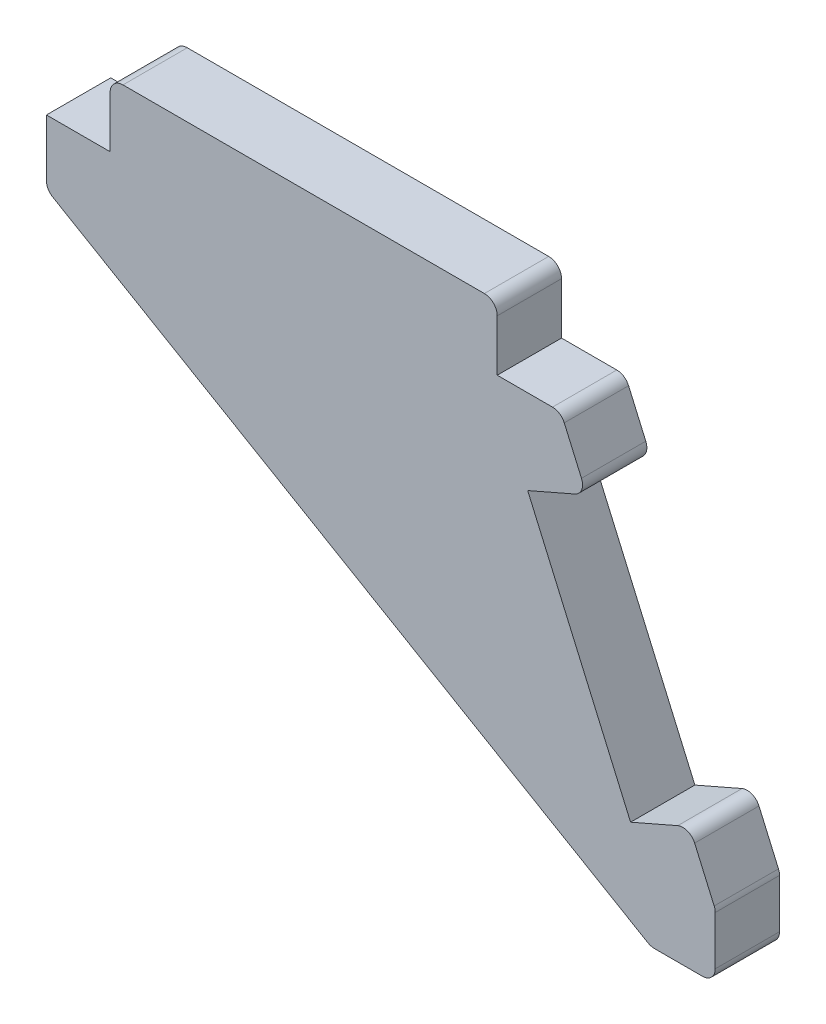
ISO-10303-21;
HEADER;
FILE_DESCRIPTION(('STEP AP214'),'2;1');
FILE_NAME('part.step','',(''),(''),'','','');
FILE_SCHEMA(('AUTOMOTIVE_DESIGN { 1 0 10303 214 1 1 1 1 }'));
ENDSEC;
DATA;
#1=APPLICATION_CONTEXT('core data for automotive mechanical design processes');
#2=APPLICATION_PROTOCOL_DEFINITION('international standard','automotive_design',2000,#1);
#3=PRODUCT_CONTEXT('',#1,'mechanical');
#4=PRODUCT('Part','Part','',(#3));
#5=PRODUCT_RELATED_PRODUCT_CATEGORY('part','',(#4));
#6=PRODUCT_DEFINITION_FORMATION('','',#4);
#7=PRODUCT_DEFINITION_CONTEXT('part definition',#1,'design');
#8=PRODUCT_DEFINITION('design','',#6,#7);
#9=PRODUCT_DEFINITION_SHAPE('','',#8);
#10=(LENGTH_UNIT() NAMED_UNIT(*) SI_UNIT(.MILLI.,.METRE.));
#11=(NAMED_UNIT(*) PLANE_ANGLE_UNIT() SI_UNIT($,.RADIAN.));
#12=(NAMED_UNIT(*) SI_UNIT($,.STERADIAN.) SOLID_ANGLE_UNIT());
#13=UNCERTAINTY_MEASURE_WITH_UNIT(LENGTH_MEASURE(1.E-05),#10,'distance_accuracy_value','');
#14=(GEOMETRIC_REPRESENTATION_CONTEXT(3) GLOBAL_UNCERTAINTY_ASSIGNED_CONTEXT((#13)) GLOBAL_UNIT_ASSIGNED_CONTEXT((#10,
#11,#12)) REPRESENTATION_CONTEXT('',''));
#15=CARTESIAN_POINT('',(0.,0.,0.));
#16=DIRECTION('',(0.,0.,1.));
#17=DIRECTION('',(1.,0.,0.));
#18=AXIS2_PLACEMENT_3D('',#15,#16,#17);
#19=CARTESIAN_POINT('',(4.95,5.00000000000043,5.));
#20=DIRECTION('',(1.,0.,0.));
#21=DIRECTION('',(0.,1.,0.));
#22=AXIS2_PLACEMENT_3D('',#19,#20,#21);
#23=PLANE('',#22);
#24=DIRECTION('',(0.,-1.,0.));
#25=VECTOR('',#24,1.);
#26=CARTESIAN_POINT('',(4.95,5.00000000000043,5.));
#27=LINE('',#26,#25);
#28=CARTESIAN_POINT('',(4.95,4.00000000000043,5.));
#29=VERTEX_POINT('',#28);
#30=CARTESIAN_POINT('',(4.95,0.,5.));
#31=VERTEX_POINT('',#30);
#32=EDGE_CURVE('E195',#29,#31,#27,.T.);
#33=ORIENTED_EDGE('',*,*,#32,.F.);
#34=DIRECTION('',(0.,0.,-1.));
#35=VECTOR('',#34,1.);
#36=CARTESIAN_POINT('',(4.95,4.00000000000043,5.));
#37=LINE('',#36,#35);
#38=CARTESIAN_POINT('',(4.95,4.00000000000043,0.));
#39=VERTEX_POINT('',#38);
#40=EDGE_CURVE('E11',#29,#39,#37,.T.);
#41=ORIENTED_EDGE('',*,*,#40,.T.);
#42=DIRECTION('',(0.,-1.,0.));
#43=VECTOR('',#42,1.);
#44=CARTESIAN_POINT('',(4.95,5.00000000000043,0.));
#45=LINE('',#44,#43);
#46=CARTESIAN_POINT('',(4.95,0.,0.));
#47=VERTEX_POINT('',#46);
#48=EDGE_CURVE('E219',#39,#47,#45,.T.);
#49=ORIENTED_EDGE('',*,*,#48,.T.);
#50=DIRECTION('',(0.,0.,-1.));
#51=VECTOR('',#50,1.);
#52=CARTESIAN_POINT('',(4.95,0.,5.));
#53=LINE('',#52,#51);
#54=EDGE_CURVE('E212',#31,#47,#53,.T.);
#55=ORIENTED_EDGE('',*,*,#54,.F.);
#56=EDGE_LOOP('',(#33,#41,#49,#55));
#57=FACE_BOUND('',#56,.T.);
#58=ADVANCED_FACE('F40',(#57),#23,.F.);
#59=CARTESIAN_POINT('',(4.95,0.,5.));
#60=DIRECTION('',(0.,-1.,0.));
#61=DIRECTION('',(1.,0.,0.));
#62=AXIS2_PLACEMENT_3D('',#59,#60,#61);
#63=PLANE('',#62);
#64=DIRECTION('',(-1.,0.,0.));
#65=VECTOR('',#64,1.);
#66=CARTESIAN_POINT('',(4.95,0.,0.));
#67=LINE('',#66,#65);
#68=CARTESIAN_POINT('',(0.,0.,0.));
#69=VERTEX_POINT('',#68);
#70=EDGE_CURVE('E373',#47,#69,#67,.T.);
#71=ORIENTED_EDGE('',*,*,#70,.T.);
#72=DIRECTION('',(0.,0.,-1.));
#73=VECTOR('',#72,1.);
#74=CARTESIAN_POINT('',(0.,0.,5.));
#75=LINE('',#74,#73);
#76=CARTESIAN_POINT('',(0.,0.,5.));
#77=VERTEX_POINT('',#76);
#78=EDGE_CURVE('E214',#77,#69,#75,.T.);
#79=ORIENTED_EDGE('',*,*,#78,.F.);
#80=DIRECTION('',(-1.,0.,0.));
#81=VECTOR('',#80,1.);
#82=CARTESIAN_POINT('',(4.95,0.,5.));
#83=LINE('',#82,#81);
#84=EDGE_CURVE('E200',#31,#77,#83,.T.);
#85=ORIENTED_EDGE('',*,*,#84,.F.);
#86=ORIENTED_EDGE('',*,*,#54,.T.);
#87=EDGE_LOOP('',(#71,#79,#85,#86));
#88=FACE_BOUND('',#87,.T.);
#89=ADVANCED_FACE('F211',(#88),#63,.F.);
#90=CARTESIAN_POINT('',(0.,0.,5.));
#91=DIRECTION('',(1.,0.,0.));
#92=DIRECTION('',(0.,1.,0.));
#93=AXIS2_PLACEMENT_3D('',#90,#91,#92);
#94=PLANE('',#93);
#95=DIRECTION('',(0.,-1.,0.));
#96=VECTOR('',#95,1.);
#97=CARTESIAN_POINT('',(0.,0.,0.));
#98=LINE('',#97,#96);
#99=CARTESIAN_POINT('',(0.,-4.42646043849972,0.));
#100=VERTEX_POINT('',#99);
#101=EDGE_CURVE('E375',#69,#100,#98,.T.);
#102=ORIENTED_EDGE('',*,*,#101,.T.);
#103=DIRECTION('',(0.,0.,-1.));
#104=VECTOR('',#103,1.);
#105=CARTESIAN_POINT('',(0.,-4.42646043849972,5.));
#106=LINE('',#105,#104);
#107=CARTESIAN_POINT('',(0.,-4.42646043849972,5.));
#108=VERTEX_POINT('',#107);
#109=EDGE_CURVE('E273',#100,#108,#106,.F.);
#110=ORIENTED_EDGE('',*,*,#109,.T.);
#111=DIRECTION('',(0.,-1.,0.));
#112=VECTOR('',#111,1.);
#113=CARTESIAN_POINT('',(0.,0.,5.));
#114=LINE('',#113,#112);
#115=EDGE_CURVE('E216',#77,#108,#114,.T.);
#116=ORIENTED_EDGE('',*,*,#115,.F.);
#117=ORIENTED_EDGE('',*,*,#78,.T.);
#118=EDGE_LOOP('',(#102,#110,#116,#117));
#119=FACE_BOUND('',#118,.T.);
#120=ADVANCED_FACE('F427',(#119),#94,.F.);
#121=CARTESIAN_POINT('',(0.,-5.,5.));
#122=DIRECTION('',(0.50495020040632,0.863148478020796,0.));
#123=DIRECTION('',(-0.863148478020796,0.50495020040632,0.));
#124=AXIS2_PLACEMENT_3D('',#121,#122,#123);
#125=PLANE('',#124);
#126=DIRECTION('',(0.863148478020796,-0.50495020040632,0.));
#127=VECTOR('',#126,1.);
#128=CARTESIAN_POINT('',(0.,-5.,5.));
#129=LINE('',#128,#127);
#130=CARTESIAN_POINT('',(0.49504979959368,-5.28960891652052,5.));
#131=VERTEX_POINT('',#130);
#132=CARTESIAN_POINT('',(46.7660696385189,-32.3586026477557,5.));
#133=VERTEX_POINT('',#132);
#134=EDGE_CURVE('E463',#131,#133,#129,.T.);
#135=ORIENTED_EDGE('',*,*,#134,.F.);
#136=DIRECTION('',(0.,0.,-1.));
#137=VECTOR('',#136,1.);
#138=CARTESIAN_POINT('',(0.49504979959368,-5.28960891652052,5.));
#139=LINE('',#138,#137);
#140=CARTESIAN_POINT('',(0.49504979959368,-5.28960891652052,0.));
#141=VERTEX_POINT('',#140);
#142=EDGE_CURVE('E270',#131,#141,#139,.T.);
#143=ORIENTED_EDGE('',*,*,#142,.T.);
#144=DIRECTION('',(0.863148478020796,-0.50495020040632,0.));
#145=VECTOR('',#144,1.);
#146=CARTESIAN_POINT('',(0.,-5.,0.));
#147=LINE('',#146,#145);
#148=CARTESIAN_POINT('',(46.7660696385189,-32.3586026477557,0.));
#149=VERTEX_POINT('',#148);
#150=EDGE_CURVE('E378',#141,#149,#147,.T.);
#151=ORIENTED_EDGE('',*,*,#150,.T.);
#152=DIRECTION('',(0.,0.,-1.));
#153=VECTOR('',#152,1.);
#154=CARTESIAN_POINT('',(46.7660696385189,-32.3586026477557,5.));
#155=LINE('',#154,#153);
#156=EDGE_CURVE('E268',#149,#133,#155,.F.);
#157=ORIENTED_EDGE('',*,*,#156,.T.);
#158=EDGE_LOOP('',(#135,#143,#151,#157));
#159=FACE_BOUND('',#158,.T.);
#160=ADVANCED_FACE('F490',(#159),#125,.F.);
#161=CARTESIAN_POINT('',(47.0000000000003,-32.4954541697349,5.));
#162=DIRECTION('',(0.,1.,0.));
#163=DIRECTION('',(0.,0.,1.));
#164=AXIS2_PLACEMENT_3D('',#161,#162,#163);
#165=PLANE('',#164);
#166=DIRECTION('',(1.,0.,0.));
#167=VECTOR('',#166,1.);
#168=CARTESIAN_POINT('',(47.0000000000003,-32.4954541697349,0.));
#169=LINE('',#168,#167);
#170=CARTESIAN_POINT('',(47.2710198389252,-32.4954541697349,0.));
#171=VERTEX_POINT('',#170);
#172=CARTESIAN_POINT('',(51.0000000000003,-32.4954541697349,0.));
#173=VERTEX_POINT('',#172);
#174=EDGE_CURVE('E381',#171,#173,#169,.T.);
#175=ORIENTED_EDGE('',*,*,#174,.T.);
#176=DIRECTION('',(0.,0.,-1.));
#177=VECTOR('',#176,1.);
#178=CARTESIAN_POINT('',(51.0000000000003,-32.4954541697349,5.));
#179=LINE('',#178,#177);
#180=CARTESIAN_POINT('',(51.0000000000003,-32.4954541697349,5.));
#181=VERTEX_POINT('',#180);
#182=EDGE_CURVE('E288',#173,#181,#179,.F.);
#183=ORIENTED_EDGE('',*,*,#182,.T.);
#184=DIRECTION('',(1.,0.,0.));
#185=VECTOR('',#184,1.);
#186=CARTESIAN_POINT('',(47.0000000000003,-32.4954541697349,5.));
#187=LINE('',#186,#185);
#188=CARTESIAN_POINT('',(47.2710198389252,-32.4954541697349,5.));
#189=VERTEX_POINT('',#188);
#190=EDGE_CURVE('E466',#189,#181,#187,.T.);
#191=ORIENTED_EDGE('',*,*,#190,.F.);
#192=DIRECTION('',(0.,0.,-1.));
#193=VECTOR('',#192,1.);
#194=CARTESIAN_POINT('',(47.2710198389252,-32.4954541697349,5.));
#195=LINE('',#194,#193);
#196=EDGE_CURVE('E285',#189,#171,#195,.T.);
#197=ORIENTED_EDGE('',*,*,#196,.T.);
#198=EDGE_LOOP('',(#175,#183,#191,#197));
#199=FACE_BOUND('',#198,.T.);
#200=ADVANCED_FACE('F482',(#199),#165,.F.);
#201=CARTESIAN_POINT('',(52.0000000000003,-27.4954541697349,5.));
#202=DIRECTION('',(-1.,0.,0.));
#203=DIRECTION('',(0.,0.,1.));
#204=AXIS2_PLACEMENT_3D('',#201,#202,#203);
#205=PLANE('',#204);
#206=DIRECTION('',(0.,1.,0.));
#207=VECTOR('',#206,1.);
#208=CARTESIAN_POINT('',(52.0000000000003,-27.4954541697349,0.));
#209=LINE('',#208,#207);
#210=CARTESIAN_POINT('',(52.0000000000003,-31.4954541697349,0.));
#211=VERTEX_POINT('',#210);
#212=CARTESIAN_POINT('',(52.0000000000003,-27.704166322257,0.));
#213=VERTEX_POINT('',#212);
#214=EDGE_CURVE('E384',#211,#213,#209,.T.);
#215=ORIENTED_EDGE('',*,*,#214,.T.);
#216=DIRECTION('',(0.,0.,-1.));
#217=VECTOR('',#216,1.);
#218=CARTESIAN_POINT('',(52.0000000000003,-27.704166322257,5.));
#219=LINE('',#218,#217);
#220=CARTESIAN_POINT('',(52.0000000000003,-27.704166322257,5.));
#221=VERTEX_POINT('',#220);
#222=EDGE_CURVE('E283',#213,#221,#219,.F.);
#223=ORIENTED_EDGE('',*,*,#222,.T.);
#224=DIRECTION('',(0.,1.,0.));
#225=VECTOR('',#224,1.);
#226=CARTESIAN_POINT('',(52.0000000000003,-27.4954541697349,5.));
#227=LINE('',#226,#225);
#228=CARTESIAN_POINT('',(52.0000000000003,-31.4954541697349,5.));
#229=VERTEX_POINT('',#228);
#230=EDGE_CURVE('E403',#229,#221,#227,.T.);
#231=ORIENTED_EDGE('',*,*,#230,.F.);
#232=DIRECTION('',(0.,0.,-1.));
#233=VECTOR('',#232,1.);
#234=CARTESIAN_POINT('',(52.0000000000003,-31.4954541697349,5.));
#235=LINE('',#234,#233);
#236=EDGE_CURVE('E280',#229,#211,#235,.T.);
#237=ORIENTED_EDGE('',*,*,#236,.T.);
#238=EDGE_LOOP('',(#215,#223,#231,#237));
#239=FACE_BOUND('',#238,.T.);
#240=ADVANCED_FACE('F478',(#239),#205,.F.);
#241=CARTESIAN_POINT('',(50.0000000000002,-22.912878474779,5.));
#242=DIRECTION('',(-0.916515138991163,-0.400000000000012,0.));
#243=DIRECTION('',(0.400000000000012,-0.916515138991163,0.));
#244=AXIS2_PLACEMENT_3D('',#241,#242,#243);
#245=PLANE('',#244);
#246=DIRECTION('',(-0.400000000000012,0.916515138991163,0.));
#247=VECTOR('',#246,1.);
#248=CARTESIAN_POINT('',(50.0000000000002,-22.912878474779,5.));
#249=LINE('',#248,#247);
#250=CARTESIAN_POINT('',(51.9165151389915,-27.304166322257,5.));
#251=VERTEX_POINT('',#250);
#252=CARTESIAN_POINT('',(50.4000000000002,-23.8293936137702,5.));
#253=VERTEX_POINT('',#252);
#254=EDGE_CURVE('E399',#251,#253,#249,.T.);
#255=ORIENTED_EDGE('',*,*,#254,.F.);
#256=DIRECTION('',(0.,0.,-1.));
#257=VECTOR('',#256,1.);
#258=CARTESIAN_POINT('',(51.9165151389915,-27.304166322257,5.));
#259=LINE('',#258,#257);
#260=CARTESIAN_POINT('',(51.9165151389915,-27.304166322257,0.));
#261=VERTEX_POINT('',#260);
#262=EDGE_CURVE('E277',#251,#261,#259,.T.);
#263=ORIENTED_EDGE('',*,*,#262,.T.);
#264=DIRECTION('',(-0.400000000000012,0.916515138991163,0.));
#265=VECTOR('',#264,1.);
#266=CARTESIAN_POINT('',(50.0000000000002,-22.912878474779,0.));
#267=LINE('',#266,#265);
#268=CARTESIAN_POINT('',(50.4000000000002,-23.8293936137702,0.));
#269=VERTEX_POINT('',#268);
#270=EDGE_CURVE('E348',#261,#269,#267,.T.);
#271=ORIENTED_EDGE('',*,*,#270,.T.);
#272=DIRECTION('',(0.,0.,-1.));
#273=VECTOR('',#272,1.);
#274=CARTESIAN_POINT('',(50.4000000000002,-23.8293936137702,5.));
#275=LINE('',#274,#273);
#276=EDGE_CURVE('E275',#269,#253,#275,.F.);
#277=ORIENTED_EDGE('',*,*,#276,.T.);
#278=EDGE_LOOP('',(#255,#263,#271,#277));
#279=FACE_BOUND('',#278,.T.);
#280=ADVANCED_FACE('F391',(#279),#245,.F.);
#281=CARTESIAN_POINT('',(45.4174243050445,-24.9128784747791,5.));
#282=DIRECTION('',(0.400000000000012,-0.916515138991163,0.));
#283=DIRECTION('',(0.916515138991163,0.400000000000012,0.));
#284=AXIS2_PLACEMENT_3D('',#281,#282,#283);
#285=PLANE('',#284);
#286=DIRECTION('',(-0.916515138991163,-0.400000000000012,0.));
#287=VECTOR('',#286,1.);
#288=CARTESIAN_POINT('',(45.4174243050445,-24.9128784747791,5.));
#289=LINE('',#288,#287);
#290=CARTESIAN_POINT('',(49.0834848610091,-23.312878474779,5.));
#291=VERTEX_POINT('',#290);
#292=CARTESIAN_POINT('',(45.4174243050445,-24.9128784747791,5.));
#293=VERTEX_POINT('',#292);
#294=EDGE_CURVE('E398',#291,#293,#289,.T.);
#295=ORIENTED_EDGE('',*,*,#294,.F.);
#296=DIRECTION('',(0.,0.,-1.));
#297=VECTOR('',#296,1.);
#298=CARTESIAN_POINT('',(49.0834848610091,-23.312878474779,5.));
#299=LINE('',#298,#297);
#300=CARTESIAN_POINT('',(49.0834848610091,-23.312878474779,0.));
#301=VERTEX_POINT('',#300);
#302=EDGE_CURVE('E290',#291,#301,#299,.T.);
#303=ORIENTED_EDGE('',*,*,#302,.T.);
#304=DIRECTION('',(-0.916515138991163,-0.400000000000012,0.));
#305=VECTOR('',#304,1.);
#306=CARTESIAN_POINT('',(45.4174243050445,-24.9128784747791,0.));
#307=LINE('',#306,#305);
#308=CARTESIAN_POINT('',(45.4174243050445,-24.9128784747791,0.));
#309=VERTEX_POINT('',#308);
#310=EDGE_CURVE('E342',#301,#309,#307,.T.);
#311=ORIENTED_EDGE('',*,*,#310,.T.);
#312=DIRECTION('',(0.,0.,-1.));
#313=VECTOR('',#312,1.);
#314=CARTESIAN_POINT('',(45.4174243050445,-24.9128784747791,5.));
#315=LINE('',#314,#313);
#316=EDGE_CURVE('E226',#293,#309,#315,.T.);
#317=ORIENTED_EDGE('',*,*,#316,.F.);
#318=EDGE_LOOP('',(#295,#303,#311,#317));
#319=FACE_BOUND('',#318,.T.);
#320=ADVANCED_FACE('F400',(#319),#285,.F.);
#321=CARTESIAN_POINT('',(37.4174243050442,-6.58257569495581,5.));
#322=DIRECTION('',(-0.916515138991163,-0.400000000000013,0.));
#323=DIRECTION('',(0.400000000000013,-0.916515138991163,0.));
#324=AXIS2_PLACEMENT_3D('',#321,#322,#323);
#325=PLANE('',#324);
#326=DIRECTION('',(-0.400000000000013,0.916515138991163,0.));
#327=VECTOR('',#326,1.);
#328=CARTESIAN_POINT('',(37.4174243050442,-6.58257569495581,0.));
#329=LINE('',#328,#327);
#330=CARTESIAN_POINT('',(37.4174243050442,-6.58257569495581,0.));
#331=VERTEX_POINT('',#330);
#332=EDGE_CURVE('E336',#309,#331,#329,.T.);
#333=ORIENTED_EDGE('',*,*,#332,.T.);
#334=DIRECTION('',(0.,0.,-1.));
#335=VECTOR('',#334,1.);
#336=CARTESIAN_POINT('',(37.4174243050442,-6.58257569495581,5.));
#337=LINE('',#336,#335);
#338=CARTESIAN_POINT('',(37.4174243050442,-6.58257569495581,5.));
#339=VERTEX_POINT('',#338);
#340=EDGE_CURVE('E327',#339,#331,#337,.T.);
#341=ORIENTED_EDGE('',*,*,#340,.F.);
#342=DIRECTION('',(-0.400000000000013,0.916515138991163,0.));
#343=VECTOR('',#342,1.);
#344=CARTESIAN_POINT('',(37.4174243050442,-6.58257569495581,5.));
#345=LINE('',#344,#343);
#346=EDGE_CURVE('E337',#293,#339,#345,.T.);
#347=ORIENTED_EDGE('',*,*,#346,.F.);
#348=ORIENTED_EDGE('',*,*,#316,.T.);
#349=EDGE_LOOP('',(#333,#341,#347,#348));
#350=FACE_BOUND('',#349,.T.);
#351=ADVANCED_FACE('F334',(#350),#325,.F.);
#352=CARTESIAN_POINT('',(42.,-4.58257569495572,5.));
#353=DIRECTION('',(-0.400000000000016,0.916515138991161,0.));
#354=DIRECTION('',(-0.916515138991161,-0.400000000000016,0.));
#355=AXIS2_PLACEMENT_3D('',#352,#353,#354);
#356=PLANE('',#355);
#357=DIRECTION('',(0.916515138991161,0.400000000000016,0.));
#358=VECTOR('',#357,1.);
#359=CARTESIAN_POINT('',(42.,-4.58257569495572,0.));
#360=LINE('',#359,#358);
#361=CARTESIAN_POINT('',(41.0834848610088,-4.98257569495574,0.));
#362=VERTEX_POINT('',#361);
#363=EDGE_CURVE('E344',#331,#362,#360,.T.);
#364=ORIENTED_EDGE('',*,*,#363,.T.);
#365=DIRECTION('',(0.,0.,-1.));
#366=VECTOR('',#365,1.);
#367=CARTESIAN_POINT('',(41.0834848610088,-4.98257569495574,5.));
#368=LINE('',#367,#366);
#369=CARTESIAN_POINT('',(41.0834848610088,-4.98257569495574,5.));
#370=VERTEX_POINT('',#369);
#371=EDGE_CURVE('E293',#362,#370,#368,.F.);
#372=ORIENTED_EDGE('',*,*,#371,.T.);
#373=DIRECTION('',(0.916515138991161,0.400000000000016,0.));
#374=VECTOR('',#373,1.);
#375=CARTESIAN_POINT('',(42.,-4.58257569495572,5.));
#376=LINE('',#375,#374);
#377=EDGE_CURVE('E367',#339,#370,#376,.T.);
#378=ORIENTED_EDGE('',*,*,#377,.F.);
#379=ORIENTED_EDGE('',*,*,#340,.T.);
#380=EDGE_LOOP('',(#364,#372,#378,#379));
#381=FACE_BOUND('',#380,.T.);
#382=ADVANCED_FACE('F413',(#381),#356,.F.);
#383=CARTESIAN_POINT('',(42.,-4.58257569495572,5.));
#384=DIRECTION('',(-0.916515138991163,-0.400000000000012,0.));
#385=DIRECTION('',(0.400000000000012,-0.916515138991163,0.));
#386=AXIS2_PLACEMENT_3D('',#383,#384,#385);
#387=PLANE('',#386);
#388=DIRECTION('',(-0.400000000000012,0.916515138991163,0.));
#389=VECTOR('',#388,1.);
#390=CARTESIAN_POINT('',(42.,-4.58257569495572,0.));
#391=LINE('',#390,#389);
#392=CARTESIAN_POINT('',(41.6,-3.66606055596456,0.));
#393=VERTEX_POINT('',#392);
#394=CARTESIAN_POINT('',(40.2618614682832,-0.599999999999984,0.));
#395=VERTEX_POINT('',#394);
#396=EDGE_CURVE('E346',#393,#395,#391,.T.);
#397=ORIENTED_EDGE('',*,*,#396,.T.);
#398=DIRECTION('',(0.,0.,-1.));
#399=VECTOR('',#398,1.);
#400=CARTESIAN_POINT('',(40.2618614682832,-0.599999999999985,5.));
#401=LINE('',#400,#399);
#402=CARTESIAN_POINT('',(40.2618614682832,-0.599999999999984,5.));
#403=VERTEX_POINT('',#402);
#404=EDGE_CURVE('E250',#395,#403,#401,.F.);
#405=ORIENTED_EDGE('',*,*,#404,.T.);
#406=DIRECTION('',(-0.400000000000012,0.916515138991163,0.));
#407=VECTOR('',#406,1.);
#408=CARTESIAN_POINT('',(42.,-4.58257569495572,5.));
#409=LINE('',#408,#407);
#410=CARTESIAN_POINT('',(41.6,-3.66606055596456,5.));
#411=VERTEX_POINT('',#410);
#412=EDGE_CURVE('E365',#411,#403,#409,.T.);
#413=ORIENTED_EDGE('',*,*,#412,.F.);
#414=DIRECTION('',(0.,0.,-1.));
#415=VECTOR('',#414,1.);
#416=CARTESIAN_POINT('',(41.6,-3.66606055596456,5.));
#417=LINE('',#416,#415);
#418=EDGE_CURVE('E247',#411,#393,#417,.T.);
#419=ORIENTED_EDGE('',*,*,#418,.T.);
#420=EDGE_LOOP('',(#397,#405,#413,#419));
#421=FACE_BOUND('',#420,.T.);
#422=ADVANCED_FACE('F360',(#421),#387,.F.);
#423=CARTESIAN_POINT('',(40.,0.,5.));
#424=DIRECTION('',(0.,-1.,0.));
#425=DIRECTION('',(1.,0.,0.));
#426=AXIS2_PLACEMENT_3D('',#423,#424,#425);
#427=PLANE('',#426);
#428=DIRECTION('',(-1.,0.,0.));
#429=VECTOR('',#428,1.);
#430=CARTESIAN_POINT('',(40.,0.,5.));
#431=LINE('',#430,#429);
#432=CARTESIAN_POINT('',(39.345346329292,0.,5.));
#433=VERTEX_POINT('',#432);
#434=CARTESIAN_POINT('',(35.05,0.,5.));
#435=VERTEX_POINT('',#434);
#436=EDGE_CURVE('E309',#433,#435,#431,.T.);
#437=ORIENTED_EDGE('',*,*,#436,.F.);
#438=DIRECTION('',(0.,0.,-1.));
#439=VECTOR('',#438,1.);
#440=CARTESIAN_POINT('',(39.345346329292,0.,5.));
#441=LINE('',#440,#439);
#442=CARTESIAN_POINT('',(39.345346329292,0.,0.));
#443=VERTEX_POINT('',#442);
#444=EDGE_CURVE('E221',#433,#443,#441,.T.);
#445=ORIENTED_EDGE('',*,*,#444,.T.);
#446=DIRECTION('',(-1.,0.,0.));
#447=VECTOR('',#446,1.);
#448=CARTESIAN_POINT('',(40.,0.,0.));
#449=LINE('',#448,#447);
#450=CARTESIAN_POINT('',(35.05,0.,0.));
#451=VERTEX_POINT('',#450);
#452=EDGE_CURVE('E321',#443,#451,#449,.T.);
#453=ORIENTED_EDGE('',*,*,#452,.T.);
#454=DIRECTION('',(0.,0.,-1.));
#455=VECTOR('',#454,1.);
#456=CARTESIAN_POINT('',(35.05,0.,5.));
#457=LINE('',#456,#455);
#458=EDGE_CURVE('E325',#435,#451,#457,.T.);
#459=ORIENTED_EDGE('',*,*,#458,.F.);
#460=EDGE_LOOP('',(#437,#445,#453,#459));
#461=FACE_BOUND('',#460,.T.);
#462=ADVANCED_FACE('F354',(#461),#427,.F.);
#463=CARTESIAN_POINT('',(35.05,5.00000000000043,5.));
#464=DIRECTION('',(-1.,0.,0.));
#465=DIRECTION('',(0.,0.,1.));
#466=AXIS2_PLACEMENT_3D('',#463,#464,#465);
#467=PLANE('',#466);
#468=DIRECTION('',(0.,1.,0.));
#469=VECTOR('',#468,1.);
#470=CARTESIAN_POINT('',(35.05,5.00000000000043,0.));
#471=LINE('',#470,#469);
#472=CARTESIAN_POINT('',(35.05,4.00000000000043,0.));
#473=VERTEX_POINT('',#472);
#474=EDGE_CURVE('E306',#451,#473,#471,.T.);
#475=ORIENTED_EDGE('',*,*,#474,.T.);
#476=DIRECTION('',(0.,0.,-1.));
#477=VECTOR('',#476,1.);
#478=CARTESIAN_POINT('',(35.05,4.00000000000043,5.));
#479=LINE('',#478,#477);
#480=CARTESIAN_POINT('',(35.05,4.00000000000043,5.));
#481=VERTEX_POINT('',#480);
#482=EDGE_CURVE('E48',#473,#481,#479,.F.);
#483=ORIENTED_EDGE('',*,*,#482,.T.);
#484=DIRECTION('',(0.,1.,0.));
#485=VECTOR('',#484,1.);
#486=CARTESIAN_POINT('',(35.05,5.00000000000043,5.));
#487=LINE('',#486,#485);
#488=EDGE_CURVE('E304',#435,#481,#487,.T.);
#489=ORIENTED_EDGE('',*,*,#488,.F.);
#490=ORIENTED_EDGE('',*,*,#458,.T.);
#491=EDGE_LOOP('',(#475,#483,#489,#490));
#492=FACE_BOUND('',#491,.T.);
#493=ADVANCED_FACE('F302',(#492),#467,.F.);
#494=CARTESIAN_POINT('',(35.05,5.00000000000043,5.));
#495=DIRECTION('',(0.,-1.,0.));
#496=DIRECTION('',(1.,0.,0.));
#497=AXIS2_PLACEMENT_3D('',#494,#495,#496);
#498=PLANE('',#497);
#499=DIRECTION('',(-1.,0.,0.));
#500=VECTOR('',#499,1.);
#501=CARTESIAN_POINT('',(35.05,5.00000000000043,5.));
#502=LINE('',#501,#500);
#503=CARTESIAN_POINT('',(34.05,5.00000000000043,5.));
#504=VERTEX_POINT('',#503);
#505=CARTESIAN_POINT('',(5.95,5.00000000000043,5.));
#506=VERTEX_POINT('',#505);
#507=EDGE_CURVE('E311',#504,#506,#502,.T.);
#508=ORIENTED_EDGE('',*,*,#507,.F.);
#509=DIRECTION('',(0.,0.,-1.));
#510=VECTOR('',#509,1.);
#511=CARTESIAN_POINT('',(34.05,5.00000000000043,5.));
#512=LINE('',#511,#510);
#513=CARTESIAN_POINT('',(34.05,5.00000000000043,0.));
#514=VERTEX_POINT('',#513);
#515=EDGE_CURVE('E296',#504,#514,#512,.T.);
#516=ORIENTED_EDGE('',*,*,#515,.T.);
#517=DIRECTION('',(-1.,0.,0.));
#518=VECTOR('',#517,1.);
#519=CARTESIAN_POINT('',(35.05,5.00000000000043,0.));
#520=LINE('',#519,#518);
#521=CARTESIAN_POINT('',(5.95,5.00000000000043,0.));
#522=VERTEX_POINT('',#521);
#523=EDGE_CURVE('E207',#514,#522,#520,.T.);
#524=ORIENTED_EDGE('',*,*,#523,.T.);
#525=DIRECTION('',(0.,0.,-1.));
#526=VECTOR('',#525,1.);
#527=CARTESIAN_POINT('',(5.95,5.00000000000043,5.));
#528=LINE('',#527,#526);
#529=EDGE_CURVE('E55',#522,#506,#528,.F.);
#530=ORIENTED_EDGE('',*,*,#529,.T.);
#531=EDGE_LOOP('',(#508,#516,#524,#530));
#532=FACE_BOUND('',#531,.T.);
#533=ADVANCED_FACE('F316',(#532),#498,.F.);
#534=CARTESIAN_POINT('',(0.,0.,5.));
#535=DIRECTION('',(0.,0.,-1.));
#536=DIRECTION('',(-1.,0.,0.));
#537=AXIS2_PLACEMENT_3D('',#534,#535,#536);
#538=PLANE('',#537);
#539=ORIENTED_EDGE('',*,*,#412,.T.);
#540=CARTESIAN_POINT('',(39.345346329292,-1.,5.));
#541=DIRECTION('',(0.,0.,-1.));
#542=DIRECTION('',(-1.,0.,0.));
#543=AXIS2_PLACEMENT_3D('',#540,#541,#542);
#544=CIRCLE('',#543,1.);
#545=EDGE_CURVE('E266',#403,#433,#544,.F.);
#546=ORIENTED_EDGE('',*,*,#545,.T.);
#547=ORIENTED_EDGE('',*,*,#436,.T.);
#548=ORIENTED_EDGE('',*,*,#488,.T.);
#549=CARTESIAN_POINT('',(34.05,4.00000000000043,5.));
#550=DIRECTION('',(0.,0.,-1.));
#551=DIRECTION('',(-1.,0.,0.));
#552=AXIS2_PLACEMENT_3D('',#549,#550,#551);
#553=CIRCLE('',#552,1.);
#554=EDGE_CURVE('E62',#481,#504,#553,.F.);
#555=ORIENTED_EDGE('',*,*,#554,.T.);
#556=ORIENTED_EDGE('',*,*,#507,.T.);
#557=CARTESIAN_POINT('',(5.95,4.00000000000043,5.));
#558=DIRECTION('',(0.,0.,-1.));
#559=DIRECTION('',(-1.,0.,0.));
#560=AXIS2_PLACEMENT_3D('',#557,#558,#559);
#561=CIRCLE('',#560,1.);
#562=EDGE_CURVE('E203',#506,#29,#561,.F.);
#563=ORIENTED_EDGE('',*,*,#562,.T.);
#564=ORIENTED_EDGE('',*,*,#32,.T.);
#565=ORIENTED_EDGE('',*,*,#84,.T.);
#566=ORIENTED_EDGE('',*,*,#115,.T.);
#567=CARTESIAN_POINT('',(1.,-4.42646043849972,5.));
#568=DIRECTION('',(0.,0.,-1.));
#569=DIRECTION('',(-1.,0.,0.));
#570=AXIS2_PLACEMENT_3D('',#567,#568,#569);
#571=CIRCLE('',#570,1.);
#572=EDGE_CURVE('E264',#108,#131,#571,.F.);
#573=ORIENTED_EDGE('',*,*,#572,.T.);
#574=ORIENTED_EDGE('',*,*,#134,.T.);
#575=CARTESIAN_POINT('',(47.2710198389252,-31.4954541697349,5.));
#576=DIRECTION('',(0.,0.,-1.));
#577=DIRECTION('',(-1.,0.,0.));
#578=AXIS2_PLACEMENT_3D('',#575,#576,#577);
#579=CIRCLE('',#578,1.);
#580=EDGE_CURVE('E258',#133,#189,#579,.F.);
#581=ORIENTED_EDGE('',*,*,#580,.T.);
#582=ORIENTED_EDGE('',*,*,#190,.T.);
#583=CARTESIAN_POINT('',(51.0000000000003,-31.4954541697349,5.));
#584=DIRECTION('',(0.,0.,-1.));
#585=DIRECTION('',(-1.,0.,0.));
#586=AXIS2_PLACEMENT_3D('',#583,#584,#585);
#587=CIRCLE('',#586,1.);
#588=EDGE_CURVE('E260',#181,#229,#587,.F.);
#589=ORIENTED_EDGE('',*,*,#588,.T.);
#590=ORIENTED_EDGE('',*,*,#230,.T.);
#591=CARTESIAN_POINT('',(51.0000000000003,-27.704166322257,5.));
#592=DIRECTION('',(0.,0.,-1.));
#593=DIRECTION('',(-1.,0.,0.));
#594=AXIS2_PLACEMENT_3D('',#591,#592,#593);
#595=CIRCLE('',#594,1.);
#596=EDGE_CURVE('E262',#221,#251,#595,.F.);
#597=ORIENTED_EDGE('',*,*,#596,.T.);
#598=ORIENTED_EDGE('',*,*,#254,.T.);
#599=CARTESIAN_POINT('',(49.4834848610091,-24.2293936137702,5.));
#600=DIRECTION('',(0.,0.,-1.));
#601=DIRECTION('',(-1.,0.,0.));
#602=AXIS2_PLACEMENT_3D('',#599,#600,#601);
#603=CIRCLE('',#602,1.);
#604=EDGE_CURVE('E256',#253,#291,#603,.F.);
#605=ORIENTED_EDGE('',*,*,#604,.T.);
#606=ORIENTED_EDGE('',*,*,#294,.T.);
#607=ORIENTED_EDGE('',*,*,#346,.T.);
#608=ORIENTED_EDGE('',*,*,#377,.T.);
#609=CARTESIAN_POINT('',(40.6834848610088,-4.06606055596458,5.));
#610=DIRECTION('',(0.,0.,-1.));
#611=DIRECTION('',(-1.,0.,0.));
#612=AXIS2_PLACEMENT_3D('',#609,#610,#611);
#613=CIRCLE('',#612,1.);
#614=EDGE_CURVE('E254',#370,#411,#613,.F.);
#615=ORIENTED_EDGE('',*,*,#614,.T.);
#616=EDGE_LOOP('',(#539,#546,#547,#548,#555,#556,#563,#564,#565,#566,#573,#574,#581,#582,#589,
#590,#597,#598,#605,#606,#607,#608,#615));
#617=FACE_BOUND('',#616,.T.);
#618=ADVANCED_FACE('F198',(#617),#538,.F.);
#619=CARTESIAN_POINT('',(0.,0.,0.));
#620=DIRECTION('',(0.,0.,-1.));
#621=DIRECTION('',(-1.,0.,0.));
#622=AXIS2_PLACEMENT_3D('',#619,#620,#621);
#623=PLANE('',#622);
#624=ORIENTED_EDGE('',*,*,#452,.F.);
#625=CARTESIAN_POINT('',(39.345346329292,-1.,0.));
#626=DIRECTION('',(0.,0.,-1.));
#627=DIRECTION('',(-1.,0.,0.));
#628=AXIS2_PLACEMENT_3D('',#625,#626,#627);
#629=CIRCLE('',#628,1.);
#630=EDGE_CURVE('E245',#443,#395,#629,.T.);
#631=ORIENTED_EDGE('',*,*,#630,.T.);
#632=ORIENTED_EDGE('',*,*,#396,.F.);
#633=CARTESIAN_POINT('',(40.6834848610088,-4.06606055596458,0.));
#634=DIRECTION('',(0.,0.,-1.));
#635=DIRECTION('',(-1.,0.,0.));
#636=AXIS2_PLACEMENT_3D('',#633,#634,#635);
#637=CIRCLE('',#636,1.);
#638=EDGE_CURVE('E233',#393,#362,#637,.T.);
#639=ORIENTED_EDGE('',*,*,#638,.T.);
#640=ORIENTED_EDGE('',*,*,#363,.F.);
#641=ORIENTED_EDGE('',*,*,#332,.F.);
#642=ORIENTED_EDGE('',*,*,#310,.F.);
#643=CARTESIAN_POINT('',(49.4834848610091,-24.2293936137702,0.));
#644=DIRECTION('',(0.,0.,-1.));
#645=DIRECTION('',(-1.,0.,0.));
#646=AXIS2_PLACEMENT_3D('',#643,#644,#645);
#647=CIRCLE('',#646,1.);
#648=EDGE_CURVE('E235',#301,#269,#647,.T.);
#649=ORIENTED_EDGE('',*,*,#648,.T.);
#650=ORIENTED_EDGE('',*,*,#270,.F.);
#651=CARTESIAN_POINT('',(51.0000000000003,-27.704166322257,0.));
#652=DIRECTION('',(0.,0.,-1.));
#653=DIRECTION('',(-1.,0.,0.));
#654=AXIS2_PLACEMENT_3D('',#651,#652,#653);
#655=CIRCLE('',#654,1.);
#656=EDGE_CURVE('E241',#261,#213,#655,.T.);
#657=ORIENTED_EDGE('',*,*,#656,.T.);
#658=ORIENTED_EDGE('',*,*,#214,.F.);
#659=CARTESIAN_POINT('',(51.0000000000003,-31.4954541697349,0.));
#660=DIRECTION('',(0.,0.,-1.));
#661=DIRECTION('',(-1.,0.,0.));
#662=AXIS2_PLACEMENT_3D('',#659,#660,#661);
#663=CIRCLE('',#662,1.);
#664=EDGE_CURVE('E239',#211,#173,#663,.T.);
#665=ORIENTED_EDGE('',*,*,#664,.T.);
#666=ORIENTED_EDGE('',*,*,#174,.F.);
#667=CARTESIAN_POINT('',(47.2710198389252,-31.4954541697349,0.));
#668=DIRECTION('',(0.,0.,-1.));
#669=DIRECTION('',(-1.,0.,0.));
#670=AXIS2_PLACEMENT_3D('',#667,#668,#669);
#671=CIRCLE('',#670,1.);
#672=EDGE_CURVE('E237',#171,#149,#671,.T.);
#673=ORIENTED_EDGE('',*,*,#672,.T.);
#674=ORIENTED_EDGE('',*,*,#150,.F.);
#675=CARTESIAN_POINT('',(1.,-4.42646043849972,0.));
#676=DIRECTION('',(0.,0.,-1.));
#677=DIRECTION('',(-1.,0.,0.));
#678=AXIS2_PLACEMENT_3D('',#675,#676,#677);
#679=CIRCLE('',#678,1.);
#680=EDGE_CURVE('E243',#141,#100,#679,.T.);
#681=ORIENTED_EDGE('',*,*,#680,.T.);
#682=ORIENTED_EDGE('',*,*,#101,.F.);
#683=ORIENTED_EDGE('',*,*,#70,.F.);
#684=ORIENTED_EDGE('',*,*,#48,.F.);
#685=CARTESIAN_POINT('',(5.95,4.00000000000043,0.));
#686=DIRECTION('',(0.,0.,-1.));
#687=DIRECTION('',(-1.,0.,0.));
#688=AXIS2_PLACEMENT_3D('',#685,#686,#687);
#689=CIRCLE('',#688,1.);
#690=EDGE_CURVE('E224',#39,#522,#689,.T.);
#691=ORIENTED_EDGE('',*,*,#690,.T.);
#692=ORIENTED_EDGE('',*,*,#523,.F.);
#693=CARTESIAN_POINT('',(34.05,4.00000000000043,0.));
#694=DIRECTION('',(0.,0.,-1.));
#695=DIRECTION('',(-1.,0.,0.));
#696=AXIS2_PLACEMENT_3D('',#693,#694,#695);
#697=CIRCLE('',#696,1.);
#698=EDGE_CURVE('E231',#514,#473,#697,.T.);
#699=ORIENTED_EDGE('',*,*,#698,.T.);
#700=ORIENTED_EDGE('',*,*,#474,.F.);
#701=EDGE_LOOP('',(#624,#631,#632,#639,#640,#641,#642,#649,#650,#657,#658,#665,#666,#673,#674,
#681,#682,#683,#684,#691,#692,#699,#700));
#702=FACE_BOUND('',#701,.T.);
#703=ADVANCED_FACE('F319',(#702),#623,.T.);
#704=CARTESIAN_POINT('',(39.345346329292,-1.,5.));
#705=DIRECTION('',(0.,0.,-1.));
#706=DIRECTION('',(-1.,0.,0.));
#707=AXIS2_PLACEMENT_3D('',#704,#705,#706);
#708=CYLINDRICAL_SURFACE('',#707,1.);
#709=ORIENTED_EDGE('',*,*,#545,.F.);
#710=ORIENTED_EDGE('',*,*,#404,.F.);
#711=ORIENTED_EDGE('',*,*,#630,.F.);
#712=ORIENTED_EDGE('',*,*,#444,.F.);
#713=EDGE_LOOP('',(#709,#710,#711,#712));
#714=FACE_BOUND('',#713,.T.);
#715=ADVANCED_FACE('F364',(#714),#708,.T.);
#716=CARTESIAN_POINT('',(1.,-4.42646043849972,5.));
#717=DIRECTION('',(0.,0.,-1.));
#718=DIRECTION('',(-1.,0.,0.));
#719=AXIS2_PLACEMENT_3D('',#716,#717,#718);
#720=CYLINDRICAL_SURFACE('',#719,1.);
#721=ORIENTED_EDGE('',*,*,#572,.F.);
#722=ORIENTED_EDGE('',*,*,#109,.F.);
#723=ORIENTED_EDGE('',*,*,#680,.F.);
#724=ORIENTED_EDGE('',*,*,#142,.F.);
#725=EDGE_LOOP('',(#721,#722,#723,#724));
#726=FACE_BOUND('',#725,.T.);
#727=ADVANCED_FACE('F433',(#726),#720,.T.);
#728=CARTESIAN_POINT('',(51.0000000000003,-27.704166322257,5.));
#729=DIRECTION('',(0.,0.,-1.));
#730=DIRECTION('',(-1.,0.,0.));
#731=AXIS2_PLACEMENT_3D('',#728,#729,#730);
#732=CYLINDRICAL_SURFACE('',#731,1.);
#733=ORIENTED_EDGE('',*,*,#596,.F.);
#734=ORIENTED_EDGE('',*,*,#222,.F.);
#735=ORIENTED_EDGE('',*,*,#656,.F.);
#736=ORIENTED_EDGE('',*,*,#262,.F.);
#737=EDGE_LOOP('',(#733,#734,#735,#736));
#738=FACE_BOUND('',#737,.T.);
#739=ADVANCED_FACE('F436',(#738),#732,.T.);
#740=CARTESIAN_POINT('',(51.0000000000003,-31.4954541697349,5.));
#741=DIRECTION('',(0.,0.,-1.));
#742=DIRECTION('',(-1.,0.,0.));
#743=AXIS2_PLACEMENT_3D('',#740,#741,#742);
#744=CYLINDRICAL_SURFACE('',#743,1.);
#745=ORIENTED_EDGE('',*,*,#588,.F.);
#746=ORIENTED_EDGE('',*,*,#182,.F.);
#747=ORIENTED_EDGE('',*,*,#664,.F.);
#748=ORIENTED_EDGE('',*,*,#236,.F.);
#749=EDGE_LOOP('',(#745,#746,#747,#748));
#750=FACE_BOUND('',#749,.T.);
#751=ADVANCED_FACE('F440',(#750),#744,.T.);
#752=CARTESIAN_POINT('',(47.2710198389252,-31.4954541697349,5.));
#753=DIRECTION('',(0.,0.,-1.));
#754=DIRECTION('',(-1.,0.,0.));
#755=AXIS2_PLACEMENT_3D('',#752,#753,#754);
#756=CYLINDRICAL_SURFACE('',#755,1.);
#757=ORIENTED_EDGE('',*,*,#580,.F.);
#758=ORIENTED_EDGE('',*,*,#156,.F.);
#759=ORIENTED_EDGE('',*,*,#672,.F.);
#760=ORIENTED_EDGE('',*,*,#196,.F.);
#761=EDGE_LOOP('',(#757,#758,#759,#760));
#762=FACE_BOUND('',#761,.T.);
#763=ADVANCED_FACE('F444',(#762),#756,.T.);
#764=CARTESIAN_POINT('',(49.4834848610091,-24.2293936137702,5.));
#765=DIRECTION('',(0.,0.,-1.));
#766=DIRECTION('',(-1.,0.,0.));
#767=AXIS2_PLACEMENT_3D('',#764,#765,#766);
#768=CYLINDRICAL_SURFACE('',#767,1.);
#769=ORIENTED_EDGE('',*,*,#604,.F.);
#770=ORIENTED_EDGE('',*,*,#276,.F.);
#771=ORIENTED_EDGE('',*,*,#648,.F.);
#772=ORIENTED_EDGE('',*,*,#302,.F.);
#773=EDGE_LOOP('',(#769,#770,#771,#772));
#774=FACE_BOUND('',#773,.T.);
#775=ADVANCED_FACE('F396',(#774),#768,.T.);
#776=CARTESIAN_POINT('',(40.6834848610088,-4.06606055596458,5.));
#777=DIRECTION('',(0.,0.,-1.));
#778=DIRECTION('',(-1.,0.,0.));
#779=AXIS2_PLACEMENT_3D('',#776,#777,#778);
#780=CYLINDRICAL_SURFACE('',#779,1.);
#781=ORIENTED_EDGE('',*,*,#614,.F.);
#782=ORIENTED_EDGE('',*,*,#371,.F.);
#783=ORIENTED_EDGE('',*,*,#638,.F.);
#784=ORIENTED_EDGE('',*,*,#418,.F.);
#785=EDGE_LOOP('',(#781,#782,#783,#784));
#786=FACE_BOUND('',#785,.T.);
#787=ADVANCED_FACE('F412',(#786),#780,.T.);
#788=CARTESIAN_POINT('',(34.05,4.00000000000043,5.));
#789=DIRECTION('',(0.,0.,-1.));
#790=DIRECTION('',(-1.,0.,0.));
#791=AXIS2_PLACEMENT_3D('',#788,#789,#790);
#792=CYLINDRICAL_SURFACE('',#791,1.);
#793=ORIENTED_EDGE('',*,*,#554,.F.);
#794=ORIENTED_EDGE('',*,*,#482,.F.);
#795=ORIENTED_EDGE('',*,*,#698,.F.);
#796=ORIENTED_EDGE('',*,*,#515,.F.);
#797=EDGE_LOOP('',(#793,#794,#795,#796));
#798=FACE_BOUND('',#797,.T.);
#799=ADVANCED_FACE('F314',(#798),#792,.T.);
#800=CARTESIAN_POINT('',(5.95,4.00000000000043,5.));
#801=DIRECTION('',(0.,0.,-1.));
#802=DIRECTION('',(-1.,0.,0.));
#803=AXIS2_PLACEMENT_3D('',#800,#801,#802);
#804=CYLINDRICAL_SURFACE('',#803,1.);
#805=ORIENTED_EDGE('',*,*,#562,.F.);
#806=ORIENTED_EDGE('',*,*,#529,.F.);
#807=ORIENTED_EDGE('',*,*,#690,.F.);
#808=ORIENTED_EDGE('',*,*,#40,.F.);
#809=EDGE_LOOP('',(#805,#806,#807,#808));
#810=FACE_BOUND('',#809,.T.);
#811=ADVANCED_FACE('F42',(#810),#804,.T.);
#812=CLOSED_SHELL('',(#58,#89,#120,#160,#200,#240,#280,#320,#351,#382,#422,#462,#493,#533,#618,
#703,#715,#727,#739,#751,#763,#775,#787,#799,#811));
#813=MANIFOLD_SOLID_BREP('B2',#812);
#814=ADVANCED_BREP_SHAPE_REPRESENTATION('',(#18,#813),#14);
#815=SHAPE_DEFINITION_REPRESENTATION(#9,#814);
ENDSEC;
END-ISO-10303-21;
